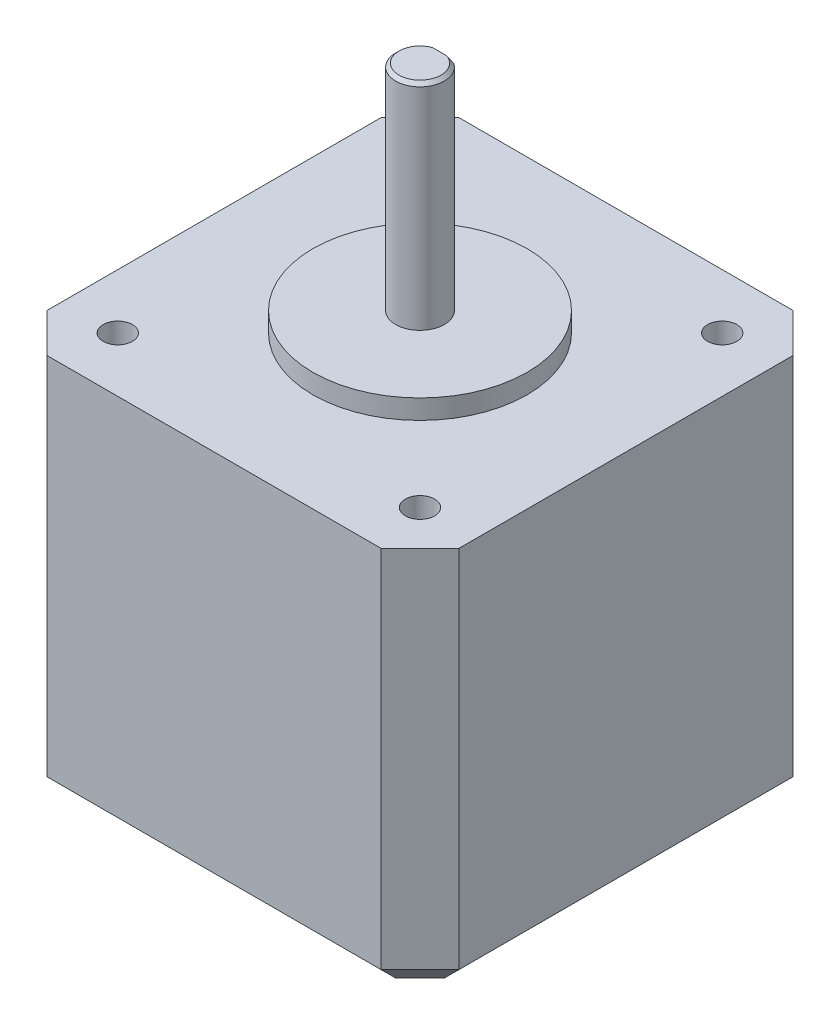
ISO-10303-21;
HEADER;
FILE_DESCRIPTION(('STEP AP214'),'2;1');
FILE_NAME('part.step','',(''),(''),'','','');
FILE_SCHEMA(('AUTOMOTIVE_DESIGN { 1 0 10303 214 1 1 1 1 }'));
ENDSEC;
DATA;
#1=APPLICATION_CONTEXT('core data for automotive mechanical design processes');
#2=APPLICATION_PROTOCOL_DEFINITION('international standard','automotive_design',2000,#1);
#3=PRODUCT_CONTEXT('',#1,'mechanical');
#4=PRODUCT('Part','Part','',(#3));
#5=PRODUCT_RELATED_PRODUCT_CATEGORY('part','',(#4));
#6=PRODUCT_DEFINITION_FORMATION('','',#4);
#7=PRODUCT_DEFINITION_CONTEXT('part definition',#1,'design');
#8=PRODUCT_DEFINITION('design','',#6,#7);
#9=PRODUCT_DEFINITION_SHAPE('','',#8);
#10=(LENGTH_UNIT() NAMED_UNIT(*) SI_UNIT(.MILLI.,.METRE.));
#11=(NAMED_UNIT(*) PLANE_ANGLE_UNIT() SI_UNIT($,.RADIAN.));
#12=(NAMED_UNIT(*) SI_UNIT($,.STERADIAN.) SOLID_ANGLE_UNIT());
#13=UNCERTAINTY_MEASURE_WITH_UNIT(LENGTH_MEASURE(1.E-05),#10,'distance_accuracy_value','');
#14=(GEOMETRIC_REPRESENTATION_CONTEXT(3) GLOBAL_UNCERTAINTY_ASSIGNED_CONTEXT((#13)) GLOBAL_UNIT_ASSIGNED_CONTEXT((#10,
#11,#12)) REPRESENTATION_CONTEXT('',''));
#15=CARTESIAN_POINT('',(0.,0.,0.));
#16=DIRECTION('',(0.,0.,1.));
#17=DIRECTION('',(1.,0.,0.));
#18=AXIS2_PLACEMENT_3D('',#15,#16,#17);
#19=CARTESIAN_POINT('',(0.,40.,0.));
#20=DIRECTION('',(0.,1.,0.));
#21=DIRECTION('',(0.,0.,1.));
#22=AXIS2_PLACEMENT_3D('',#19,#20,#21);
#23=PLANE('',#22);
#24=CARTESIAN_POINT('',(5.635,40.,-36.665));
#25=DIRECTION('',(0.,-1.,0.));
#26=DIRECTION('',(0.,0.,1.));
#27=AXIS2_PLACEMENT_3D('',#24,#25,#26);
#28=CIRCLE('',#27,1.5);
#29=CARTESIAN_POINT('',(5.635,40.,-35.165));
#30=VERTEX_POINT('',#29);
#31=EDGE_CURVE('E171',#30,#30,#28,.T.);
#32=ORIENTED_EDGE('',*,*,#31,.T.);
#33=EDGE_LOOP('',(#32));
#34=FACE_BOUND('',#33,.T.);
#35=CARTESIAN_POINT('',(36.665,40.,-5.63499999999999));
#36=DIRECTION('',(0.,-1.,0.));
#37=DIRECTION('',(0.,0.,1.));
#38=AXIS2_PLACEMENT_3D('',#35,#36,#37);
#39=CIRCLE('',#38,1.5);
#40=CARTESIAN_POINT('',(36.665,40.,-4.135));
#41=VERTEX_POINT('',#40);
#42=EDGE_CURVE('E181',#41,#41,#39,.T.);
#43=ORIENTED_EDGE('',*,*,#42,.T.);
#44=EDGE_LOOP('',(#43));
#45=FACE_BOUND('',#44,.T.);
#46=DIRECTION('',(-1.,0.,0.));
#47=VECTOR('',#46,1.);
#48=CARTESIAN_POINT('',(38.3,40.,-42.3));
#49=LINE('',#48,#47);
#50=CARTESIAN_POINT('',(38.3,40.,-42.3));
#51=VERTEX_POINT('',#50);
#52=CARTESIAN_POINT('',(4.,40.,-42.3));
#53=VERTEX_POINT('',#52);
#54=EDGE_CURVE('E193',#51,#53,#49,.T.);
#55=ORIENTED_EDGE('',*,*,#54,.T.);
#56=DIRECTION('',(-0.707106781186548,0.,0.707106781186547));
#57=VECTOR('',#56,1.);
#58=CARTESIAN_POINT('',(4.,40.,-42.3));
#59=LINE('',#58,#57);
#60=CARTESIAN_POINT('',(0.,40.,-38.3));
#61=VERTEX_POINT('',#60);
#62=EDGE_CURVE('E198',#53,#61,#59,.T.);
#63=ORIENTED_EDGE('',*,*,#62,.T.);
#64=DIRECTION('',(0.,0.,1.));
#65=VECTOR('',#64,1.);
#66=CARTESIAN_POINT('',(0.,40.,-38.3));
#67=LINE('',#66,#65);
#68=CARTESIAN_POINT('',(0.,40.,-3.99999999999999));
#69=VERTEX_POINT('',#68);
#70=EDGE_CURVE('E200',#61,#69,#67,.T.);
#71=ORIENTED_EDGE('',*,*,#70,.T.);
#72=DIRECTION('',(0.707106781186548,0.,0.707106781186547));
#73=VECTOR('',#72,1.);
#74=CARTESIAN_POINT('',(0.,40.,-3.99999999999999));
#75=LINE('',#74,#73);
#76=CARTESIAN_POINT('',(4.00000000000001,40.,0.));
#77=VERTEX_POINT('',#76);
#78=EDGE_CURVE('E202',#69,#77,#75,.T.);
#79=ORIENTED_EDGE('',*,*,#78,.T.);
#80=DIRECTION('',(1.,0.,0.));
#81=VECTOR('',#80,1.);
#82=CARTESIAN_POINT('',(4.00000000000001,40.,0.));
#83=LINE('',#82,#81);
#84=CARTESIAN_POINT('',(38.3,40.,0.));
#85=VERTEX_POINT('',#84);
#86=EDGE_CURVE('E204',#77,#85,#83,.T.);
#87=ORIENTED_EDGE('',*,*,#86,.T.);
#88=DIRECTION('',(0.707106781186548,0.,-0.707106781186547));
#89=VECTOR('',#88,1.);
#90=CARTESIAN_POINT('',(38.3,40.,0.));
#91=LINE('',#90,#89);
#92=CARTESIAN_POINT('',(42.3,40.,-3.99999999999999));
#93=VERTEX_POINT('',#92);
#94=EDGE_CURVE('E206',#85,#93,#91,.T.);
#95=ORIENTED_EDGE('',*,*,#94,.T.);
#96=DIRECTION('',(0.,0.,-1.));
#97=VECTOR('',#96,1.);
#98=CARTESIAN_POINT('',(42.3,40.,-3.99999999999999));
#99=LINE('',#98,#97);
#100=CARTESIAN_POINT('',(42.3,40.,-38.3));
#101=VERTEX_POINT('',#100);
#102=EDGE_CURVE('E208',#93,#101,#99,.T.);
#103=ORIENTED_EDGE('',*,*,#102,.T.);
#104=DIRECTION('',(-0.707106781186548,0.,-0.707106781186547));
#105=VECTOR('',#104,1.);
#106=CARTESIAN_POINT('',(42.3,40.,-38.3));
#107=LINE('',#106,#105);
#108=EDGE_CURVE('E210',#101,#51,#107,.T.);
#109=ORIENTED_EDGE('',*,*,#108,.T.);
#110=EDGE_LOOP('',(#55,#63,#71,#79,#87,#95,#103,#109));
#111=FACE_BOUND('',#110,.T.);
#112=CARTESIAN_POINT('',(5.635,40.,-5.635));
#113=DIRECTION('',(0.,-1.,0.));
#114=DIRECTION('',(0.,0.,-1.));
#115=AXIS2_PLACEMENT_3D('',#112,#113,#114);
#116=CIRCLE('',#115,1.5);
#117=CARTESIAN_POINT('',(5.635,40.,-7.135));
#118=VERTEX_POINT('',#117);
#119=EDGE_CURVE('E187',#118,#118,#116,.T.);
#120=ORIENTED_EDGE('',*,*,#119,.T.);
#121=EDGE_LOOP('',(#120));
#122=FACE_BOUND('',#121,.T.);
#123=CARTESIAN_POINT('',(36.665,40.,-36.665));
#124=DIRECTION('',(0.,-1.,0.));
#125=DIRECTION('',(0.,0.,-1.));
#126=AXIS2_PLACEMENT_3D('',#123,#124,#125);
#127=CIRCLE('',#126,1.5);
#128=CARTESIAN_POINT('',(36.665,40.,-38.165));
#129=VERTEX_POINT('',#128);
#130=EDGE_CURVE('E175',#129,#129,#127,.T.);
#131=ORIENTED_EDGE('',*,*,#130,.T.);
#132=EDGE_LOOP('',(#131));
#133=FACE_BOUND('',#132,.T.);
#134=CARTESIAN_POINT('',(21.15,40.,-21.15));
#135=DIRECTION('',(0.,1.,0.));
#136=DIRECTION('',(-1.,0.,0.));
#137=AXIS2_PLACEMENT_3D('',#134,#135,#136);
#138=CIRCLE('',#137,11.);
#139=CARTESIAN_POINT('',(10.15,40.,-21.15));
#140=VERTEX_POINT('',#139);
#141=EDGE_CURVE('E165',#140,#140,#138,.T.);
#142=ORIENTED_EDGE('',*,*,#141,.F.);
#143=EDGE_LOOP('',(#142));
#144=FACE_BOUND('',#143,.T.);
#145=ADVANCED_FACE('F32',(#34,#45,#111,#122,#133,#144),#23,.T.);
#146=CARTESIAN_POINT('',(38.3,40.,-42.3));
#147=DIRECTION('',(0.,0.,1.));
#148=DIRECTION('',(1.,0.,0.));
#149=AXIS2_PLACEMENT_3D('',#146,#147,#148);
#150=PLANE('',#149);
#151=DIRECTION('',(0.,-1.,0.));
#152=VECTOR('',#151,1.);
#153=CARTESIAN_POINT('',(38.3,40.,-42.3));
#154=LINE('',#153,#152);
#155=CARTESIAN_POINT('',(38.3,2.53999999999999,-42.3));
#156=VERTEX_POINT('',#155);
#157=EDGE_CURVE('E212',#51,#156,#154,.T.);
#158=ORIENTED_EDGE('',*,*,#157,.T.);
#159=DIRECTION('',(-1.,0.,0.));
#160=VECTOR('',#159,1.);
#161=CARTESIAN_POINT('',(38.3,2.53999999999999,-42.3));
#162=LINE('',#161,#160);
#163=CARTESIAN_POINT('',(4.,2.53999999999999,-42.3));
#164=VERTEX_POINT('',#163);
#165=EDGE_CURVE('E11',#156,#164,#162,.T.);
#166=ORIENTED_EDGE('',*,*,#165,.T.);
#167=DIRECTION('',(0.,-1.,0.));
#168=VECTOR('',#167,1.);
#169=CARTESIAN_POINT('',(4.,40.,-42.3));
#170=LINE('',#169,#168);
#171=EDGE_CURVE('E230',#53,#164,#170,.T.);
#172=ORIENTED_EDGE('',*,*,#171,.F.);
#173=ORIENTED_EDGE('',*,*,#54,.F.);
#174=EDGE_LOOP('',(#158,#166,#172,#173));
#175=FACE_BOUND('',#174,.T.);
#176=ADVANCED_FACE('F301',(#175),#150,.F.);
#177=CARTESIAN_POINT('',(4.,40.,-42.3));
#178=DIRECTION('',(0.707106781186547,0.,0.707106781186548));
#179=DIRECTION('',(0.707106781186548,0.,-0.707106781186547));
#180=AXIS2_PLACEMENT_3D('',#177,#178,#179);
#181=PLANE('',#180);
#182=ORIENTED_EDGE('',*,*,#171,.T.);
#183=DIRECTION('',(-0.707106781186548,0.,0.707106781186547));
#184=VECTOR('',#183,1.);
#185=CARTESIAN_POINT('',(4.,2.53999999999999,-42.3));
#186=LINE('',#185,#184);
#187=CARTESIAN_POINT('',(0.,2.53999999999999,-38.3));
#188=VERTEX_POINT('',#187);
#189=EDGE_CURVE('E245',#164,#188,#186,.T.);
#190=ORIENTED_EDGE('',*,*,#189,.T.);
#191=DIRECTION('',(0.,-1.,0.));
#192=VECTOR('',#191,1.);
#193=CARTESIAN_POINT('',(0.,40.,-38.3));
#194=LINE('',#193,#192);
#195=EDGE_CURVE('E227',#61,#188,#194,.T.);
#196=ORIENTED_EDGE('',*,*,#195,.F.);
#197=ORIENTED_EDGE('',*,*,#62,.F.);
#198=EDGE_LOOP('',(#182,#190,#196,#197));
#199=FACE_BOUND('',#198,.T.);
#200=ADVANCED_FACE('F327',(#199),#181,.F.);
#201=CARTESIAN_POINT('',(0.,40.,-38.3));
#202=DIRECTION('',(1.,0.,0.));
#203=DIRECTION('',(0.,0.,-1.));
#204=AXIS2_PLACEMENT_3D('',#201,#202,#203);
#205=PLANE('',#204);
#206=ORIENTED_EDGE('',*,*,#195,.T.);
#207=DIRECTION('',(0.,0.,1.));
#208=VECTOR('',#207,1.);
#209=CARTESIAN_POINT('',(0.,2.53999999999999,-38.3));
#210=LINE('',#209,#208);
#211=CARTESIAN_POINT('',(0.,2.53999999999999,-3.99999999999999));
#212=VERTEX_POINT('',#211);
#213=EDGE_CURVE('E591',#188,#212,#210,.T.);
#214=ORIENTED_EDGE('',*,*,#213,.T.);
#215=DIRECTION('',(0.,-1.,0.));
#216=VECTOR('',#215,1.);
#217=CARTESIAN_POINT('',(0.,40.,-3.99999999999999));
#218=LINE('',#217,#216);
#219=EDGE_CURVE('E224',#69,#212,#218,.T.);
#220=ORIENTED_EDGE('',*,*,#219,.F.);
#221=ORIENTED_EDGE('',*,*,#70,.F.);
#222=EDGE_LOOP('',(#206,#214,#220,#221));
#223=FACE_BOUND('',#222,.T.);
#224=ADVANCED_FACE('F323',(#223),#205,.F.);
#225=CARTESIAN_POINT('',(0.,40.,-3.99999999999999));
#226=DIRECTION('',(0.707106781186547,0.,-0.707106781186548));
#227=DIRECTION('',(-0.707106781186548,0.,-0.707106781186547));
#228=AXIS2_PLACEMENT_3D('',#225,#226,#227);
#229=PLANE('',#228);
#230=ORIENTED_EDGE('',*,*,#219,.T.);
#231=DIRECTION('',(0.707106781186548,0.,0.707106781186547));
#232=VECTOR('',#231,1.);
#233=CARTESIAN_POINT('',(0.,2.53999999999999,-3.99999999999999));
#234=LINE('',#233,#232);
#235=CARTESIAN_POINT('',(4.00000000000001,2.53999999999999,0.));
#236=VERTEX_POINT('',#235);
#237=EDGE_CURVE('E627',#212,#236,#234,.T.);
#238=ORIENTED_EDGE('',*,*,#237,.T.);
#239=DIRECTION('',(0.,-1.,0.));
#240=VECTOR('',#239,1.);
#241=CARTESIAN_POINT('',(4.00000000000001,40.,0.));
#242=LINE('',#241,#240);
#243=EDGE_CURVE('E221',#77,#236,#242,.T.);
#244=ORIENTED_EDGE('',*,*,#243,.F.);
#245=ORIENTED_EDGE('',*,*,#78,.F.);
#246=EDGE_LOOP('',(#230,#238,#244,#245));
#247=FACE_BOUND('',#246,.T.);
#248=ADVANCED_FACE('F319',(#247),#229,.F.);
#249=CARTESIAN_POINT('',(4.00000000000001,40.,0.));
#250=DIRECTION('',(0.,0.,-1.));
#251=DIRECTION('',(-1.,0.,0.));
#252=AXIS2_PLACEMENT_3D('',#249,#250,#251);
#253=PLANE('',#252);
#254=ORIENTED_EDGE('',*,*,#243,.T.);
#255=DIRECTION('',(1.,0.,0.));
#256=VECTOR('',#255,1.);
#257=CARTESIAN_POINT('',(4.00000000000001,2.53999999999999,0.));
#258=LINE('',#257,#256);
#259=CARTESIAN_POINT('',(38.3,2.53999999999999,0.));
#260=VERTEX_POINT('',#259);
#261=EDGE_CURVE('E629',#236,#260,#258,.T.);
#262=ORIENTED_EDGE('',*,*,#261,.T.);
#263=DIRECTION('',(0.,-1.,0.));
#264=VECTOR('',#263,1.);
#265=CARTESIAN_POINT('',(38.3,40.,0.));
#266=LINE('',#265,#264);
#267=EDGE_CURVE('E218',#85,#260,#266,.T.);
#268=ORIENTED_EDGE('',*,*,#267,.F.);
#269=ORIENTED_EDGE('',*,*,#86,.F.);
#270=EDGE_LOOP('',(#254,#262,#268,#269));
#271=FACE_BOUND('',#270,.T.);
#272=ADVANCED_FACE('F315',(#271),#253,.F.);
#273=CARTESIAN_POINT('',(38.3,40.,0.));
#274=DIRECTION('',(-0.707106781186547,0.,-0.707106781186548));
#275=DIRECTION('',(-0.707106781186548,0.,0.707106781186547));
#276=AXIS2_PLACEMENT_3D('',#273,#274,#275);
#277=PLANE('',#276);
#278=ORIENTED_EDGE('',*,*,#267,.T.);
#279=DIRECTION('',(0.707106781186548,0.,-0.707106781186547));
#280=VECTOR('',#279,1.);
#281=CARTESIAN_POINT('',(38.3,2.53999999999999,0.));
#282=LINE('',#281,#280);
#283=CARTESIAN_POINT('',(42.3,2.53999999999999,-3.99999999999999));
#284=VERTEX_POINT('',#283);
#285=EDGE_CURVE('E613',#260,#284,#282,.T.);
#286=ORIENTED_EDGE('',*,*,#285,.T.);
#287=DIRECTION('',(0.,-1.,0.));
#288=VECTOR('',#287,1.);
#289=CARTESIAN_POINT('',(42.3,40.,-3.99999999999999));
#290=LINE('',#289,#288);
#291=EDGE_CURVE('E216',#93,#284,#290,.T.);
#292=ORIENTED_EDGE('',*,*,#291,.F.);
#293=ORIENTED_EDGE('',*,*,#94,.F.);
#294=EDGE_LOOP('',(#278,#286,#292,#293));
#295=FACE_BOUND('',#294,.T.);
#296=ADVANCED_FACE('F312',(#295),#277,.F.);
#297=CARTESIAN_POINT('',(42.3,40.,-3.99999999999999));
#298=DIRECTION('',(-1.,0.,0.));
#299=DIRECTION('',(0.,0.,1.));
#300=AXIS2_PLACEMENT_3D('',#297,#298,#299);
#301=PLANE('',#300);
#302=ORIENTED_EDGE('',*,*,#291,.T.);
#303=DIRECTION('',(0.,0.,-1.));
#304=VECTOR('',#303,1.);
#305=CARTESIAN_POINT('',(42.3,2.53999999999999,-3.99999999999999));
#306=LINE('',#305,#304);
#307=CARTESIAN_POINT('',(42.3,2.53999999999999,-38.3));
#308=VERTEX_POINT('',#307);
#309=EDGE_CURVE('E56',#284,#308,#306,.T.);
#310=ORIENTED_EDGE('',*,*,#309,.T.);
#311=DIRECTION('',(0.,-1.,0.));
#312=VECTOR('',#311,1.);
#313=CARTESIAN_POINT('',(42.3,40.,-38.3));
#314=LINE('',#313,#312);
#315=EDGE_CURVE('E214',#101,#308,#314,.T.);
#316=ORIENTED_EDGE('',*,*,#315,.F.);
#317=ORIENTED_EDGE('',*,*,#102,.F.);
#318=EDGE_LOOP('',(#302,#310,#316,#317));
#319=FACE_BOUND('',#318,.T.);
#320=ADVANCED_FACE('F309',(#319),#301,.F.);
#321=CARTESIAN_POINT('',(42.3,40.,-38.3));
#322=DIRECTION('',(-0.707106781186547,0.,0.707106781186548));
#323=DIRECTION('',(0.707106781186548,0.,0.707106781186547));
#324=AXIS2_PLACEMENT_3D('',#321,#322,#323);
#325=PLANE('',#324);
#326=ORIENTED_EDGE('',*,*,#315,.T.);
#327=DIRECTION('',(-0.707106781186548,0.,-0.707106781186547));
#328=VECTOR('',#327,1.);
#329=CARTESIAN_POINT('',(42.3,2.53999999999999,-38.3));
#330=LINE('',#329,#328);
#331=EDGE_CURVE('E41',#308,#156,#330,.T.);
#332=ORIENTED_EDGE('',*,*,#331,.T.);
#333=ORIENTED_EDGE('',*,*,#157,.F.);
#334=ORIENTED_EDGE('',*,*,#108,.F.);
#335=EDGE_LOOP('',(#326,#332,#333,#334));
#336=FACE_BOUND('',#335,.T.);
#337=ADVANCED_FACE('F305',(#336),#325,.F.);
#338=CARTESIAN_POINT('',(0.,0.,0.));
#339=DIRECTION('',(0.,1.,0.));
#340=DIRECTION('',(0.,0.,1.));
#341=AXIS2_PLACEMENT_3D('',#338,#339,#340);
#342=PLANE('',#341);
#343=DIRECTION('',(0.,0.,-1.));
#344=VECTOR('',#343,1.);
#345=CARTESIAN_POINT('',(2.54000000000001,0.,0.));
#346=LINE('',#345,#344);
#347=CARTESIAN_POINT('',(2.54000000000001,0.,-5.05210244842766));
#348=VERTEX_POINT('',#347);
#349=CARTESIAN_POINT('',(2.54000000000001,0.,-37.2478975515723));
#350=VERTEX_POINT('',#349);
#351=EDGE_CURVE('E592',#348,#350,#346,.T.);
#352=ORIENTED_EDGE('',*,*,#351,.T.);
#353=DIRECTION('',(0.707106781186548,0.,-0.707106781186547));
#354=VECTOR('',#353,1.);
#355=CARTESIAN_POINT('',(-17.3539487757862,0.,-17.3539487757862));
#356=LINE('',#355,#354);
#357=CARTESIAN_POINT('',(5.05210244842766,0.,-39.76));
#358=VERTEX_POINT('',#357);
#359=EDGE_CURVE('E624',#350,#358,#356,.T.);
#360=ORIENTED_EDGE('',*,*,#359,.T.);
#361=DIRECTION('',(1.,0.,0.));
#362=VECTOR('',#361,1.);
#363=CARTESIAN_POINT('',(0.,0.,-39.76));
#364=LINE('',#363,#362);
#365=CARTESIAN_POINT('',(37.2478975515723,0.,-39.76));
#366=VERTEX_POINT('',#365);
#367=EDGE_CURVE('E356',#358,#366,#364,.T.);
#368=ORIENTED_EDGE('',*,*,#367,.T.);
#369=DIRECTION('',(0.707106781186548,0.,0.707106781186547));
#370=VECTOR('',#369,1.);
#371=CARTESIAN_POINT('',(38.5039487757861,0.,-38.5039487757862));
#372=LINE('',#371,#370);
#373=CARTESIAN_POINT('',(39.76,0.,-37.2478975515723));
#374=VERTEX_POINT('',#373);
#375=EDGE_CURVE('E346',#366,#374,#372,.T.);
#376=ORIENTED_EDGE('',*,*,#375,.T.);
#377=DIRECTION('',(0.,0.,1.));
#378=VECTOR('',#377,1.);
#379=CARTESIAN_POINT('',(39.76,0.,0.));
#380=LINE('',#379,#378);
#381=CARTESIAN_POINT('',(39.76,0.,-5.05210244842766));
#382=VERTEX_POINT('',#381);
#383=EDGE_CURVE('E610',#374,#382,#380,.T.);
#384=ORIENTED_EDGE('',*,*,#383,.T.);
#385=DIRECTION('',(-0.707106781186548,0.,0.707106781186547));
#386=VECTOR('',#385,1.);
#387=CARTESIAN_POINT('',(17.3539487757861,0.,17.3539487757862));
#388=LINE('',#387,#386);
#389=CARTESIAN_POINT('',(37.2478975515723,0.,-2.54000000000001));
#390=VERTEX_POINT('',#389);
#391=EDGE_CURVE('E614',#382,#390,#388,.T.);
#392=ORIENTED_EDGE('',*,*,#391,.T.);
#393=DIRECTION('',(-1.,0.,0.));
#394=VECTOR('',#393,1.);
#395=CARTESIAN_POINT('',(0.,0.,-2.54000000000001));
#396=LINE('',#395,#394);
#397=CARTESIAN_POINT('',(5.05210244842767,0.,-2.54000000000001));
#398=VERTEX_POINT('',#397);
#399=EDGE_CURVE('E615',#390,#398,#396,.T.);
#400=ORIENTED_EDGE('',*,*,#399,.T.);
#401=DIRECTION('',(-0.707106781186548,0.,-0.707106781186547));
#402=VECTOR('',#401,1.);
#403=CARTESIAN_POINT('',(3.79605122421383,0.,-3.79605122421384));
#404=LINE('',#403,#402);
#405=EDGE_CURVE('E617',#398,#348,#404,.T.);
#406=ORIENTED_EDGE('',*,*,#405,.T.);
#407=EDGE_LOOP('',(#352,#360,#368,#376,#384,#392,#400,#406));
#408=FACE_BOUND('',#407,.T.);
#409=ADVANCED_FACE('F297',(#408),#342,.F.);
#410=CARTESIAN_POINT('',(5.635,35.,-5.635));
#411=DIRECTION('',(0.,1.,0.));
#412=DIRECTION('',(0.,0.,1.));
#413=AXIS2_PLACEMENT_3D('',#410,#411,#412);
#414=CYLINDRICAL_SURFACE('',#413,1.5);
#415=CARTESIAN_POINT('',(5.635,35.,-5.635));
#416=DIRECTION('',(0.,-1.,0.));
#417=DIRECTION('',(0.,0.,-1.));
#418=AXIS2_PLACEMENT_3D('',#415,#416,#417);
#419=CIRCLE('',#418,1.5);
#420=CARTESIAN_POINT('',(5.635,35.,-7.135));
#421=VERTEX_POINT('',#420);
#422=EDGE_CURVE('E190',#421,#421,#419,.T.);
#423=ORIENTED_EDGE('',*,*,#422,.T.);
#424=EDGE_LOOP('',(#423));
#425=FACE_BOUND('',#424,.T.);
#426=ORIENTED_EDGE('',*,*,#119,.F.);
#427=EDGE_LOOP('',(#426));
#428=FACE_BOUND('',#427,.T.);
#429=ADVANCED_FACE('F293',(#425,#428),#414,.F.);
#430=CARTESIAN_POINT('',(5.635,35.,-5.635));
#431=DIRECTION('',(0.,-1.,0.));
#432=DIRECTION('',(0.,0.,-1.));
#433=AXIS2_PLACEMENT_3D('',#430,#431,#432);
#434=PLANE('',#433);
#435=ORIENTED_EDGE('',*,*,#422,.F.);
#436=EDGE_LOOP('',(#435));
#437=FACE_BOUND('',#436,.T.);
#438=ADVANCED_FACE('F289',(#437),#434,.F.);
#439=CARTESIAN_POINT('',(36.665,35.,-5.63499999999999));
#440=DIRECTION('',(0.,1.,0.));
#441=DIRECTION('',(0.,0.,1.));
#442=AXIS2_PLACEMENT_3D('',#439,#440,#441);
#443=CYLINDRICAL_SURFACE('',#442,1.5);
#444=CARTESIAN_POINT('',(36.665,35.,-5.63499999999999));
#445=DIRECTION('',(0.,-1.,0.));
#446=DIRECTION('',(0.,0.,1.));
#447=AXIS2_PLACEMENT_3D('',#444,#445,#446);
#448=CIRCLE('',#447,1.5);
#449=CARTESIAN_POINT('',(36.665,35.,-4.135));
#450=VERTEX_POINT('',#449);
#451=EDGE_CURVE('E184',#450,#450,#448,.T.);
#452=ORIENTED_EDGE('',*,*,#451,.T.);
#453=EDGE_LOOP('',(#452));
#454=FACE_BOUND('',#453,.T.);
#455=ORIENTED_EDGE('',*,*,#42,.F.);
#456=EDGE_LOOP('',(#455));
#457=FACE_BOUND('',#456,.T.);
#458=ADVANCED_FACE('F285',(#454,#457),#443,.F.);
#459=CARTESIAN_POINT('',(36.665,35.,-5.63499999999999));
#460=DIRECTION('',(0.,1.,0.));
#461=DIRECTION('',(0.,0.,1.));
#462=AXIS2_PLACEMENT_3D('',#459,#460,#461);
#463=PLANE('',#462);
#464=ORIENTED_EDGE('',*,*,#451,.F.);
#465=EDGE_LOOP('',(#464));
#466=FACE_BOUND('',#465,.T.);
#467=ADVANCED_FACE('F281',(#466),#463,.T.);
#468=CARTESIAN_POINT('',(36.665,35.,-36.665));
#469=DIRECTION('',(0.,1.,0.));
#470=DIRECTION('',(0.,0.,1.));
#471=AXIS2_PLACEMENT_3D('',#468,#469,#470);
#472=CYLINDRICAL_SURFACE('',#471,1.5);
#473=CARTESIAN_POINT('',(36.665,35.,-36.665));
#474=DIRECTION('',(0.,-1.,0.));
#475=DIRECTION('',(0.,0.,-1.));
#476=AXIS2_PLACEMENT_3D('',#473,#474,#475);
#477=CIRCLE('',#476,1.5);
#478=CARTESIAN_POINT('',(36.665,35.,-38.165));
#479=VERTEX_POINT('',#478);
#480=EDGE_CURVE('E178',#479,#479,#477,.T.);
#481=ORIENTED_EDGE('',*,*,#480,.T.);
#482=EDGE_LOOP('',(#481));
#483=FACE_BOUND('',#482,.T.);
#484=ORIENTED_EDGE('',*,*,#130,.F.);
#485=EDGE_LOOP('',(#484));
#486=FACE_BOUND('',#485,.T.);
#487=ADVANCED_FACE('F277',(#483,#486),#472,.F.);
#488=CARTESIAN_POINT('',(36.665,35.,-36.665));
#489=DIRECTION('',(0.,-1.,0.));
#490=DIRECTION('',(0.,0.,-1.));
#491=AXIS2_PLACEMENT_3D('',#488,#489,#490);
#492=PLANE('',#491);
#493=ORIENTED_EDGE('',*,*,#480,.F.);
#494=EDGE_LOOP('',(#493));
#495=FACE_BOUND('',#494,.T.);
#496=ADVANCED_FACE('F273',(#495),#492,.F.);
#497=CARTESIAN_POINT('',(5.635,35.,-36.665));
#498=DIRECTION('',(0.,1.,0.));
#499=DIRECTION('',(0.,0.,1.));
#500=AXIS2_PLACEMENT_3D('',#497,#498,#499);
#501=CYLINDRICAL_SURFACE('',#500,1.5);
#502=CARTESIAN_POINT('',(5.635,35.,-36.665));
#503=DIRECTION('',(0.,-1.,0.));
#504=DIRECTION('',(0.,0.,1.));
#505=AXIS2_PLACEMENT_3D('',#502,#503,#504);
#506=CIRCLE('',#505,1.5);
#507=CARTESIAN_POINT('',(5.635,35.,-35.165));
#508=VERTEX_POINT('',#507);
#509=EDGE_CURVE('E172',#508,#508,#506,.T.);
#510=ORIENTED_EDGE('',*,*,#509,.T.);
#511=EDGE_LOOP('',(#510));
#512=FACE_BOUND('',#511,.T.);
#513=ORIENTED_EDGE('',*,*,#31,.F.);
#514=EDGE_LOOP('',(#513));
#515=FACE_BOUND('',#514,.T.);
#516=ADVANCED_FACE('F269',(#512,#515),#501,.F.);
#517=CARTESIAN_POINT('',(5.635,35.,-36.665));
#518=DIRECTION('',(0.,1.,0.));
#519=DIRECTION('',(0.,0.,1.));
#520=AXIS2_PLACEMENT_3D('',#517,#518,#519);
#521=PLANE('',#520);
#522=ORIENTED_EDGE('',*,*,#509,.F.);
#523=EDGE_LOOP('',(#522));
#524=FACE_BOUND('',#523,.T.);
#525=ADVANCED_FACE('F265',(#524),#521,.T.);
#526=CARTESIAN_POINT('',(21.15,64.,-21.15));
#527=DIRECTION('',(0.,1.,0.));
#528=DIRECTION('',(-1.,0.,0.));
#529=AXIS2_PLACEMENT_3D('',#526,#527,#528);
#530=CYLINDRICAL_SURFACE('',#529,11.);
#531=CARTESIAN_POINT('',(21.15,42.,-21.15));
#532=DIRECTION('',(0.,1.,0.));
#533=DIRECTION('',(-1.,0.,0.));
#534=AXIS2_PLACEMENT_3D('',#531,#532,#533);
#535=CIRCLE('',#534,11.);
#536=CARTESIAN_POINT('',(10.15,42.,-21.15));
#537=VERTEX_POINT('',#536);
#538=EDGE_CURVE('E162',#537,#537,#535,.T.);
#539=ORIENTED_EDGE('',*,*,#538,.F.);
#540=EDGE_LOOP('',(#539));
#541=FACE_BOUND('',#540,.T.);
#542=ORIENTED_EDGE('',*,*,#141,.T.);
#543=EDGE_LOOP('',(#542));
#544=FACE_BOUND('',#543,.T.);
#545=ADVANCED_FACE('F262',(#541,#544),#530,.T.);
#546=CARTESIAN_POINT('',(32.15,42.,-21.15));
#547=DIRECTION('',(0.,-1.,0.));
#548=DIRECTION('',(1.,0.,0.));
#549=AXIS2_PLACEMENT_3D('',#546,#547,#548);
#550=PLANE('',#549);
#551=CARTESIAN_POINT('',(21.15,42.,-21.15));
#552=DIRECTION('',(0.,1.,0.));
#553=DIRECTION('',(-1.,0.,0.));
#554=AXIS2_PLACEMENT_3D('',#551,#552,#553);
#555=CIRCLE('',#554,2.50000000000001);
#556=CARTESIAN_POINT('',(19.6786908686479,42.,-23.1712));
#557=VERTEX_POINT('',#556);
#558=CARTESIAN_POINT('',(22.6213091313521,42.,-23.1712));
#559=VERTEX_POINT('',#558);
#560=EDGE_CURVE('E158',#557,#559,#555,.T.);
#561=ORIENTED_EDGE('',*,*,#560,.F.);
#562=DIRECTION('',(1.,0.,0.));
#563=VECTOR('',#562,1.);
#564=CARTESIAN_POINT('',(22.6213091313521,42.,-23.1712));
#565=LINE('',#564,#563);
#566=EDGE_CURVE('E144',#557,#559,#565,.T.);
#567=ORIENTED_EDGE('',*,*,#566,.T.);
#568=EDGE_LOOP('',(#561,#567));
#569=FACE_BOUND('',#568,.T.);
#570=ORIENTED_EDGE('',*,*,#538,.T.);
#571=EDGE_LOOP('',(#570));
#572=FACE_BOUND('',#571,.T.);
#573=ADVANCED_FACE('F156',(#569,#572),#550,.F.);
#574=CARTESIAN_POINT('',(21.15,64.,-21.15));
#575=DIRECTION('',(0.,1.,0.));
#576=DIRECTION('',(-1.,0.,0.));
#577=AXIS2_PLACEMENT_3D('',#574,#575,#576);
#578=CYLINDRICAL_SURFACE('',#577,2.5);
#579=ORIENTED_EDGE('',*,*,#560,.T.);
#580=DIRECTION('',(0.,1.,0.));
#581=VECTOR('',#580,1.);
#582=CARTESIAN_POINT('',(22.6213091313521,39.0186828950948,-23.1712));
#583=LINE('',#582,#581);
#584=CARTESIAN_POINT('',(22.6213091313521,63.65,-23.1712));
#585=VERTEX_POINT('',#584);
#586=EDGE_CURVE('E141',#559,#585,#583,.T.);
#587=ORIENTED_EDGE('',*,*,#586,.T.);
#588=CARTESIAN_POINT('',(21.15,63.65,-21.15));
#589=DIRECTION('',(0.,-1.,0.));
#590=DIRECTION('',(0.,0.,-1.));
#591=AXIS2_PLACEMENT_3D('',#588,#589,#590);
#592=CIRCLE('',#591,2.5);
#593=CARTESIAN_POINT('',(19.6786908686479,63.65,-23.1712));
#594=VERTEX_POINT('',#593);
#595=EDGE_CURVE('E236',#585,#594,#592,.T.);
#596=ORIENTED_EDGE('',*,*,#595,.T.);
#597=DIRECTION('',(0.,1.,0.));
#598=VECTOR('',#597,1.);
#599=CARTESIAN_POINT('',(19.6786908686479,39.0186828950948,-23.1712));
#600=LINE('',#599,#598);
#601=EDGE_CURVE('E152',#557,#594,#600,.T.);
#602=ORIENTED_EDGE('',*,*,#601,.F.);
#603=EDGE_LOOP('',(#579,#587,#596,#602));
#604=FACE_BOUND('',#603,.T.);
#605=ADVANCED_FACE('F161',(#604),#578,.T.);
#606=CARTESIAN_POINT('',(23.65,64.,-21.15));
#607=DIRECTION('',(0.,-1.,0.));
#608=DIRECTION('',(1.,0.,0.));
#609=AXIS2_PLACEMENT_3D('',#606,#607,#608);
#610=PLANE('',#609);
#611=CARTESIAN_POINT('',(21.15,64.,-21.15));
#612=DIRECTION('',(0.,-1.,0.));
#613=DIRECTION('',(1.,0.,0.));
#614=AXIS2_PLACEMENT_3D('',#611,#612,#613);
#615=CIRCLE('',#614,2.14999999999998);
#616=CARTESIAN_POINT('',(20.4170262214786,64.,-23.1712));
#617=VERTEX_POINT('',#616);
#618=CARTESIAN_POINT('',(21.8829737785214,64.,-23.1712));
#619=VERTEX_POINT('',#618);
#620=EDGE_CURVE('E233',#617,#619,#615,.F.);
#621=ORIENTED_EDGE('',*,*,#620,.T.);
#622=DIRECTION('',(1.,0.,0.));
#623=VECTOR('',#622,1.);
#624=CARTESIAN_POINT('',(22.6213091313521,64.,-23.1712));
#625=LINE('',#624,#623);
#626=EDGE_CURVE('E159',#617,#619,#625,.T.);
#627=ORIENTED_EDGE('',*,*,#626,.F.);
#628=EDGE_LOOP('',(#621,#627));
#629=FACE_BOUND('',#628,.T.);
#630=ADVANCED_FACE('F254',(#629),#610,.F.);
#631=CARTESIAN_POINT('',(21.15,64.,-21.15));
#632=DIRECTION('',(0.,-1.,0.));
#633=DIRECTION('',(0.,0.,-1.));
#634=AXIS2_PLACEMENT_3D('',#631,#632,#633);
#635=CONICAL_SURFACE('',#634,2.14999999999998,0.785398163397438);
#636=CARTESIAN_POINT('',(17.9004748939165,62.3231654262214,-23.1712));
#637=CARTESIAN_POINT('',(17.998734635847,62.4065647553399,-23.1712));
#638=CARTESIAN_POINT('',(18.0974867170333,62.489397586902,-23.1712));
#639=CARTESIAN_POINT('',(18.2963507906679,62.6535252818354,-23.1712));
#640=CARTESIAN_POINT('',(18.3964635054352,62.7348192687444,-23.1712));
#641=CARTESIAN_POINT('',(18.6013544926367,62.8977877600062,-23.1712));
#642=CARTESIAN_POINT('',(18.7061824874724,62.9794000390356,-23.1712));
#643=CARTESIAN_POINT('',(18.9180418106682,63.1396715378512,-23.1712));
#644=CARTESIAN_POINT('',(19.0250725594584,63.2183315194219,-23.1712));
#645=CARTESIAN_POINT('',(19.2422806753496,63.3717439968015,-23.1712));
#646=CARTESIAN_POINT('',(19.3524645514786,63.4464873489264,-23.1712));
#647=CARTESIAN_POINT('',(19.576763571248,63.5901391348179,-23.1712));
#648=CARTESIAN_POINT('',(19.6908820327598,63.6590424658261,-23.1712));
#649=CARTESIAN_POINT('',(19.922712384915,63.7873226026111,-23.1712));
#650=CARTESIAN_POINT('',(20.0403676098458,63.8468001687798,-23.1712));
#651=CARTESIAN_POINT('',(20.2813910125286,63.9527069271921,-23.1712));
#652=CARTESIAN_POINT('',(20.4047464635656,63.9991636927306,-23.1712));
#653=CARTESIAN_POINT('',(20.59587610888,64.0551382201605,-23.1712));
#654=CARTESIAN_POINT('',(20.6616017150064,64.0716449731498,-23.1712));
#655=CARTESIAN_POINT('',(20.7942741509613,64.098761425604,-23.1712));
#656=CARTESIAN_POINT('',(20.8612207928313,64.109372024904,-23.1712));
#657=CARTESIAN_POINT('',(20.9955947054367,64.1240065054274,-23.1712));
#658=CARTESIAN_POINT('',(21.0630193224455,64.1280543373799,-23.1712));
#659=CARTESIAN_POINT('',(21.1979364340271,64.1293571091117,-23.1712));
#660=CARTESIAN_POINT('',(21.2654289290282,64.1266120057612,-23.1712));
#661=CARTESIAN_POINT('',(21.3995254527631,64.1145470991367,-23.1712));
#662=CARTESIAN_POINT('',(21.466132023308,64.1052549748667,-23.1712));
#663=CARTESIAN_POINT('',(21.5982429772647,64.0807121014501,-23.1712));
#664=CARTESIAN_POINT('',(21.663746957447,64.0654592197369,-23.1712));
#665=CARTESIAN_POINT('',(21.7936676059839,64.0297095027082,-23.1712));
#666=CARTESIAN_POINT('',(21.8580764981625,64.0091848101127,-23.1712));
#667=CARTESIAN_POINT('',(21.9853215562204,63.9637982830892,-23.1712));
#668=CARTESIAN_POINT('',(22.0481578284569,63.938936742876,-23.1712));
#669=CARTESIAN_POINT('',(22.1984518725324,63.8744472741638,-23.1712));
#670=CARTESIAN_POINT('',(22.2851298538279,63.8330109861948,-23.1712));
#671=CARTESIAN_POINT('',(22.4557542469058,63.7448165318627,-23.1712));
#672=CARTESIAN_POINT('',(22.5396988876803,63.6980550000143,-23.1712));
#673=CARTESIAN_POINT('',(22.7054349256703,63.6004641267023,-23.1712));
#674=CARTESIAN_POINT('',(22.7872208301094,63.5496255308679,-23.1712));
#675=CARTESIAN_POINT('',(22.948819934065,63.4449645989395,-23.1712));
#676=CARTESIAN_POINT('',(23.0286335781912,63.3911429443589,-23.1712));
#677=CARTESIAN_POINT('',(23.1869688338965,63.2809853477126,-23.1712));
#678=CARTESIAN_POINT('',(23.2654840753907,63.2246402908749,-23.1712));
#679=CARTESIAN_POINT('',(23.4211851423199,63.1101384570204,-23.1712));
#680=CARTESIAN_POINT('',(23.498370871443,63.0519815496004,-23.1712));
#681=CARTESIAN_POINT('',(23.7281000264103,62.8755264632778,-23.1712));
#682=CARTESIAN_POINT('',(23.8790118671872,62.7551042821731,-23.1712));
#683=CARTESIAN_POINT('',(24.0908772829037,62.5817021440829,-23.1712));
#684=CARTESIAN_POINT('',(24.1530922971479,62.5302410147245,-23.1712));
#685=CARTESIAN_POINT('',(24.2767784910116,62.4269860978931,-23.1712));
#686=CARTESIAN_POINT('',(24.3382517456076,62.3751947971011,-23.1712));
#687=CARTESIAN_POINT('',(24.3995251060835,62.3231654262214,-23.1712));
#688=B_SPLINE_CURVE_WITH_KNOTS('',3,(#636,#637,#638,#639,#640,#641,#642,#643,#644,#645,#646,
#647,#648,#649,#650,#651,#652,#653,#654,#655,#656,#657,#658,#659,#660,#661,#662,#663,#664,#665,
#666,#667,#668,#669,#670,#671,#672,#673,#674,#675,#676,#677,#678,#679,#680,#681,#682,#683,#684,
#685,#686,#687),.UNSPECIFIED.,.F.,.F.,(4,2,2,2,2,2,2,2,2,2,2,2,2,2,2,2,2,2,2,2,2,2,2,2,2,4),(0.,
0.386655261179291,0.77352449338035,1.17204069501865,1.57045335008743,1.96975809705734,
2.36940821780792,2.76444636318946,3.15864153041679,3.36171843512495,3.56476433895411,
3.76706754783014,3.96937204117188,4.17082633925805,4.37235277726544,4.57496685117057,
4.77756718493766,5.06552151216303,5.35365884343814,5.64246979801389,5.9312150402894,
6.22110401839435,6.51101390891222,7.09011114464938,7.33233056546836,7.57347600662164),.UNSPECIFIED.);
#689=EDGE_CURVE('E244',#594,#617,#688,.T.);
#690=ORIENTED_EDGE('',*,*,#689,.F.);
#691=ORIENTED_EDGE('',*,*,#595,.F.);
#692=EDGE_CURVE('E147',#619,#585,#688,.T.);
#693=ORIENTED_EDGE('',*,*,#692,.F.);
#694=ORIENTED_EDGE('',*,*,#620,.F.);
#695=EDGE_LOOP('',(#690,#691,#693,#694));
#696=FACE_BOUND('',#695,.T.);
#697=ADVANCED_FACE('F247',(#696),#635,.T.);
#698=CARTESIAN_POINT('',(22.6213091313521,39.0186828950948,-23.1712));
#699=DIRECTION('',(0.,0.,1.));
#700=DIRECTION('',(1.,0.,0.));
#701=AXIS2_PLACEMENT_3D('',#698,#699,#700);
#702=PLANE('',#701);
#703=ORIENTED_EDGE('',*,*,#689,.T.);
#704=ORIENTED_EDGE('',*,*,#626,.T.);
#705=ORIENTED_EDGE('',*,*,#692,.T.);
#706=ORIENTED_EDGE('',*,*,#586,.F.);
#707=ORIENTED_EDGE('',*,*,#566,.F.);
#708=ORIENTED_EDGE('',*,*,#601,.T.);
#709=EDGE_LOOP('',(#703,#704,#705,#706,#707,#708));
#710=FACE_BOUND('',#709,.T.);
#711=ADVANCED_FACE('F143',(#710),#702,.F.);
#712=CARTESIAN_POINT('',(38.3,2.53999999999999,0.));
#713=DIRECTION('',(-0.499999999999998,0.70710678118655,-0.499999999999999));
#714=DIRECTION('',(0.707106781186548,0.,-0.707106781186547));
#715=AXIS2_PLACEMENT_3D('',#712,#713,#714);
#716=PLANE('',#715);
#717=DIRECTION('',(-0.281084637714822,-0.678598344545845,-0.678598344545849));
#718=VECTOR('',#717,1.);
#719=CARTESIAN_POINT('',(38.3,2.53999999999999,0.));
#720=LINE('',#719,#718);
#721=EDGE_CURVE('E601',#390,#260,#720,.F.);
#722=ORIENTED_EDGE('',*,*,#721,.F.);
#723=ORIENTED_EDGE('',*,*,#391,.F.);
#724=DIRECTION('',(-0.678598344545848,-0.678598344545845,-0.281084637714823));
#725=VECTOR('',#724,1.);
#726=CARTESIAN_POINT('',(42.3,2.53999999999999,-3.99999999999999));
#727=LINE('',#726,#725);
#728=EDGE_CURVE('E36',#284,#382,#727,.T.);
#729=ORIENTED_EDGE('',*,*,#728,.F.);
#730=ORIENTED_EDGE('',*,*,#285,.F.);
#731=EDGE_LOOP('',(#722,#723,#729,#730));
#732=FACE_BOUND('',#731,.T.);
#733=ADVANCED_FACE('F34',(#732),#716,.F.);
#734=CARTESIAN_POINT('',(42.3,2.53999999999999,-3.99999999999999));
#735=DIRECTION('',(-0.707106781186546,0.707106781186549,0.));
#736=DIRECTION('',(0.,0.,-1.));
#737=AXIS2_PLACEMENT_3D('',#734,#735,#736);
#738=PLANE('',#737);
#739=ORIENTED_EDGE('',*,*,#728,.T.);
#740=ORIENTED_EDGE('',*,*,#383,.F.);
#741=DIRECTION('',(-0.678598344545849,-0.678598344545845,0.28108463771482));
#742=VECTOR('',#741,1.);
#743=CARTESIAN_POINT('',(42.3,2.53999999999999,-38.3));
#744=LINE('',#743,#742);
#745=EDGE_CURVE('E600',#308,#374,#744,.T.);
#746=ORIENTED_EDGE('',*,*,#745,.F.);
#747=ORIENTED_EDGE('',*,*,#309,.F.);
#748=EDGE_LOOP('',(#739,#740,#746,#747));
#749=FACE_BOUND('',#748,.T.);
#750=ADVANCED_FACE('F387',(#749),#738,.F.);
#751=CARTESIAN_POINT('',(4.00000000000001,2.53999999999999,0.));
#752=DIRECTION('',(0.,0.707106781186549,-0.707106781186546));
#753=DIRECTION('',(1.,0.,0.));
#754=AXIS2_PLACEMENT_3D('',#751,#752,#753);
#755=PLANE('',#754);
#756=ORIENTED_EDGE('',*,*,#721,.T.);
#757=ORIENTED_EDGE('',*,*,#261,.F.);
#758=DIRECTION('',(0.281084637714821,-0.678598344545845,-0.678598344545849));
#759=VECTOR('',#758,1.);
#760=CARTESIAN_POINT('',(4.,2.53999999999999,0.));
#761=LINE('',#760,#759);
#762=EDGE_CURVE('E349',#398,#236,#761,.F.);
#763=ORIENTED_EDGE('',*,*,#762,.F.);
#764=ORIENTED_EDGE('',*,*,#399,.F.);
#765=EDGE_LOOP('',(#756,#757,#763,#764));
#766=FACE_BOUND('',#765,.T.);
#767=ADVANCED_FACE('F395',(#766),#755,.F.);
#768=CARTESIAN_POINT('',(42.3,2.53999999999999,-38.3));
#769=DIRECTION('',(-0.499999999999999,0.707106781186549,0.5));
#770=DIRECTION('',(-0.707106781186548,0.,-0.707106781186547));
#771=AXIS2_PLACEMENT_3D('',#768,#769,#770);
#772=PLANE('',#771);
#773=ORIENTED_EDGE('',*,*,#745,.T.);
#774=ORIENTED_EDGE('',*,*,#375,.F.);
#775=DIRECTION('',(-0.281084637714817,-0.678598344545845,0.67859834454585));
#776=VECTOR('',#775,1.);
#777=CARTESIAN_POINT('',(38.3,2.53999999999999,-42.3));
#778=LINE('',#777,#776);
#779=EDGE_CURVE('E343',#156,#366,#778,.T.);
#780=ORIENTED_EDGE('',*,*,#779,.F.);
#781=ORIENTED_EDGE('',*,*,#331,.F.);
#782=EDGE_LOOP('',(#773,#774,#780,#781));
#783=FACE_BOUND('',#782,.T.);
#784=ADVANCED_FACE('F345',(#783),#772,.F.);
#785=CARTESIAN_POINT('',(0.,2.53999999999999,-3.99999999999999));
#786=DIRECTION('',(0.499999999999998,0.707106781186549,-0.499999999999999));
#787=DIRECTION('',(0.707106781186548,0.,0.707106781186547));
#788=AXIS2_PLACEMENT_3D('',#785,#786,#787);
#789=PLANE('',#788);
#790=ORIENTED_EDGE('',*,*,#762,.T.);
#791=ORIENTED_EDGE('',*,*,#237,.F.);
#792=DIRECTION('',(0.678598344545849,-0.678598344545845,-0.281084637714821));
#793=VECTOR('',#792,1.);
#794=CARTESIAN_POINT('',(0.,2.53999999999999,-3.99999999999999));
#795=LINE('',#794,#793);
#796=EDGE_CURVE('E350',#348,#212,#795,.F.);
#797=ORIENTED_EDGE('',*,*,#796,.F.);
#798=ORIENTED_EDGE('',*,*,#405,.F.);
#799=EDGE_LOOP('',(#790,#791,#797,#798));
#800=FACE_BOUND('',#799,.T.);
#801=ADVANCED_FACE('F409',(#800),#789,.F.);
#802=CARTESIAN_POINT('',(38.3,2.53999999999999,-42.3));
#803=DIRECTION('',(0.,0.70710678118655,0.707106781186545));
#804=DIRECTION('',(-1.,0.,0.));
#805=AXIS2_PLACEMENT_3D('',#802,#803,#804);
#806=PLANE('',#805);
#807=ORIENTED_EDGE('',*,*,#779,.T.);
#808=ORIENTED_EDGE('',*,*,#367,.F.);
#809=DIRECTION('',(-0.281084637714819,0.678598344545845,-0.67859834454585));
#810=VECTOR('',#809,1.);
#811=CARTESIAN_POINT('',(6.70999407308299,-4.00250444518769,-35.7574955548123));
#812=LINE('',#811,#810);
#813=EDGE_CURVE('E354',#164,#358,#812,.F.);
#814=ORIENTED_EDGE('',*,*,#813,.F.);
#815=ORIENTED_EDGE('',*,*,#165,.F.);
#816=EDGE_LOOP('',(#807,#808,#814,#815));
#817=FACE_BOUND('',#816,.T.);
#818=ADVANCED_FACE('F353',(#817),#806,.F.);
#819=CARTESIAN_POINT('',(0.,2.53999999999999,-38.3));
#820=DIRECTION('',(0.707106781186546,0.707106781186549,0.));
#821=DIRECTION('',(0.,0.,1.));
#822=AXIS2_PLACEMENT_3D('',#819,#820,#821);
#823=PLANE('',#822);
#824=ORIENTED_EDGE('',*,*,#796,.T.);
#825=ORIENTED_EDGE('',*,*,#213,.F.);
#826=DIRECTION('',(0.678598344545849,-0.678598344545845,0.281084637714821));
#827=VECTOR('',#826,1.);
#828=CARTESIAN_POINT('',(0.,2.53999999999999,-38.3));
#829=LINE('',#828,#827);
#830=EDGE_CURVE('E360',#350,#188,#829,.F.);
#831=ORIENTED_EDGE('',*,*,#830,.F.);
#832=ORIENTED_EDGE('',*,*,#351,.F.);
#833=EDGE_LOOP('',(#824,#825,#831,#832));
#834=FACE_BOUND('',#833,.T.);
#835=ADVANCED_FACE('F423',(#834),#823,.F.);
#836=CARTESIAN_POINT('',(4.,2.53999999999999,-42.3));
#837=DIRECTION('',(0.499999999999998,0.707106781186549,0.499999999999999));
#838=DIRECTION('',(-0.707106781186548,0.,0.707106781186547));
#839=AXIS2_PLACEMENT_3D('',#836,#837,#838);
#840=PLANE('',#839);
#841=ORIENTED_EDGE('',*,*,#813,.T.);
#842=ORIENTED_EDGE('',*,*,#359,.F.);
#843=ORIENTED_EDGE('',*,*,#830,.T.);
#844=ORIENTED_EDGE('',*,*,#189,.F.);
#845=EDGE_LOOP('',(#841,#842,#843,#844));
#846=FACE_BOUND('',#845,.T.);
#847=ADVANCED_FACE('F363',(#846),#840,.F.);
#848=CLOSED_SHELL('',(#145,#176,#200,#224,#248,#272,#296,#320,#337,#409,#429,#438,#458,#467,
#487,#496,#516,#525,#545,#573,#605,#630,#697,#711,#733,#750,#767,#784,#801,#818,#835,#847));
#849=MANIFOLD_SOLID_BREP('B2',#848);
#850=ADVANCED_BREP_SHAPE_REPRESENTATION('',(#18,#849),#14);
#851=SHAPE_DEFINITION_REPRESENTATION(#9,#850);
ENDSEC;
END-ISO-10303-21;
